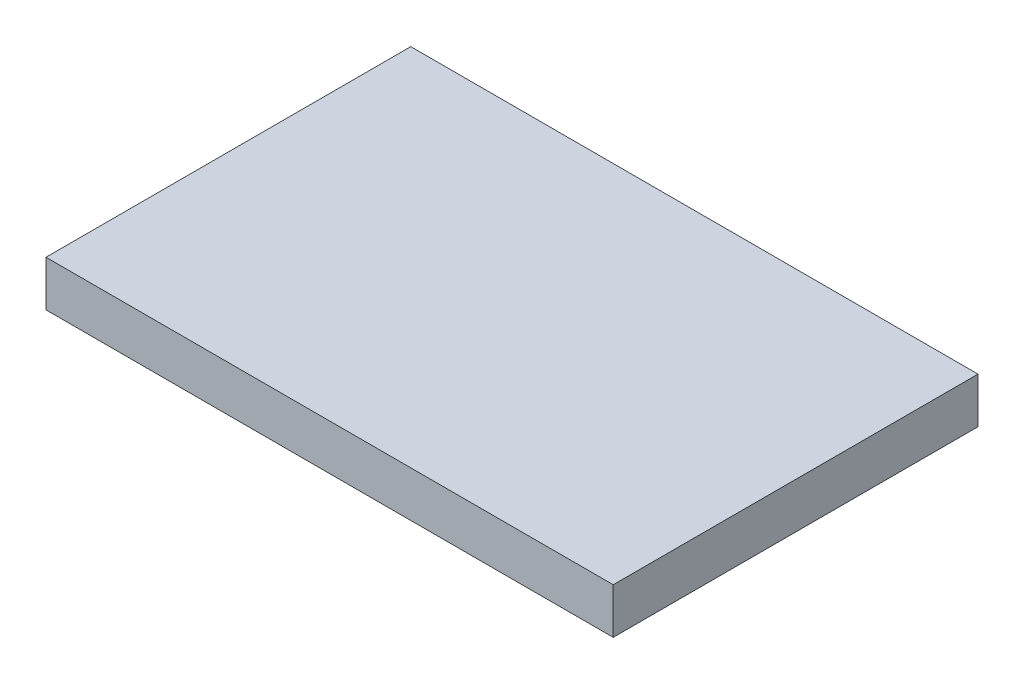
ISO-10303-21;
HEADER;
FILE_DESCRIPTION(('STEP AP214'),'2;1');
FILE_NAME('part.step','',(''),(''),'','','');
FILE_SCHEMA(('AUTOMOTIVE_DESIGN { 1 0 10303 214 1 1 1 1 }'));
ENDSEC;
DATA;
#1=APPLICATION_CONTEXT('core data for automotive mechanical design processes');
#2=APPLICATION_PROTOCOL_DEFINITION('international standard','automotive_design',2000,#1);
#3=PRODUCT_CONTEXT('',#1,'mechanical');
#4=PRODUCT('Part','Part','',(#3));
#5=PRODUCT_RELATED_PRODUCT_CATEGORY('part','',(#4));
#6=PRODUCT_DEFINITION_FORMATION('','',#4);
#7=PRODUCT_DEFINITION_CONTEXT('part definition',#1,'design');
#8=PRODUCT_DEFINITION('design','',#6,#7);
#9=PRODUCT_DEFINITION_SHAPE('','',#8);
#10=(LENGTH_UNIT() NAMED_UNIT(*) SI_UNIT(.MILLI.,.METRE.));
#11=(NAMED_UNIT(*) PLANE_ANGLE_UNIT() SI_UNIT($,.RADIAN.));
#12=(NAMED_UNIT(*) SI_UNIT($,.STERADIAN.) SOLID_ANGLE_UNIT());
#13=UNCERTAINTY_MEASURE_WITH_UNIT(LENGTH_MEASURE(1.E-05),#10,'distance_accuracy_value','');
#14=(GEOMETRIC_REPRESENTATION_CONTEXT(3) GLOBAL_UNCERTAINTY_ASSIGNED_CONTEXT((#13)) GLOBAL_UNIT_ASSIGNED_CONTEXT((#10,
#11,#12)) REPRESENTATION_CONTEXT('',''));
#15=CARTESIAN_POINT('',(0.,0.,0.));
#16=DIRECTION('',(0.,0.,1.));
#17=DIRECTION('',(1.,0.,0.));
#18=AXIS2_PLACEMENT_3D('',#15,#16,#17);
#19=CARTESIAN_POINT('',(62.1970259018667,39.8750870967758,39.9989784718606));
#20=DIRECTION('',(1.,0.,0.));
#21=DIRECTION('',(0.,0.,-1.));
#22=AXIS2_PLACEMENT_3D('',#19,#20,#21);
#23=PLANE('',#22);
#24=DIRECTION('',(0.,0.,1.));
#25=VECTOR('',#24,1.);
#26=CARTESIAN_POINT('',(62.1970259018667,29.8750870967758,39.9989784718606));
#27=LINE('',#26,#25);
#28=CARTESIAN_POINT('',(62.1970259018667,29.8750870967758,-39.9989784718606));
#29=VERTEX_POINT('',#28);
#30=CARTESIAN_POINT('',(62.1970259018667,29.8750870967758,39.9989784718606));
#31=VERTEX_POINT('',#30);
#32=EDGE_CURVE('E161',#29,#31,#27,.T.);
#33=ORIENTED_EDGE('',*,*,#32,.F.);
#34=DIRECTION('',(0.,-1.,0.));
#35=VECTOR('',#34,1.);
#36=CARTESIAN_POINT('',(62.1970259018667,39.8750870967758,-39.9989784718606));
#37=LINE('',#36,#35);
#38=CARTESIAN_POINT('',(62.1970259018667,39.8750870967758,-39.9989784718606));
#39=VERTEX_POINT('',#38);
#40=EDGE_CURVE('E159',#39,#29,#37,.T.);
#41=ORIENTED_EDGE('',*,*,#40,.F.);
#42=DIRECTION('',(0.,0.,1.));
#43=VECTOR('',#42,1.);
#44=CARTESIAN_POINT('',(62.1970259018667,39.8750870967758,39.9989784718606));
#45=LINE('',#44,#43);
#46=CARTESIAN_POINT('',(62.1970259018667,39.8750870967758,39.9989784718606));
#47=VERTEX_POINT('',#46);
#48=EDGE_CURVE('E164',#39,#47,#45,.T.);
#49=ORIENTED_EDGE('',*,*,#48,.T.);
#50=DIRECTION('',(0.,-1.,0.));
#51=VECTOR('',#50,1.);
#52=CARTESIAN_POINT('',(62.1970259018667,39.8750870967758,39.9989784718606));
#53=LINE('',#52,#51);
#54=EDGE_CURVE('E176',#47,#31,#53,.T.);
#55=ORIENTED_EDGE('',*,*,#54,.T.);
#56=EDGE_LOOP('',(#33,#41,#49,#55));
#57=FACE_BOUND('',#56,.T.);
#58=ADVANCED_FACE('F40',(#57),#23,.T.);
#59=CARTESIAN_POINT('',(-62.1970259018667,39.8750870967758,-39.9989784718606));
#60=DIRECTION('',(0.,0.,-1.));
#61=DIRECTION('',(-1.,0.,0.));
#62=AXIS2_PLACEMENT_3D('',#59,#60,#61);
#63=PLANE('',#62);
#64=DIRECTION('',(1.,0.,0.));
#65=VECTOR('',#64,1.);
#66=CARTESIAN_POINT('',(-62.1970259018667,29.8750870967758,-39.9989784718606));
#67=LINE('',#66,#65);
#68=CARTESIAN_POINT('',(-62.1970259018667,29.8750870967758,-39.9989784718606));
#69=VERTEX_POINT('',#68);
#70=EDGE_CURVE('E158',#69,#29,#67,.T.);
#71=ORIENTED_EDGE('',*,*,#70,.F.);
#72=DIRECTION('',(0.,-1.,0.));
#73=VECTOR('',#72,1.);
#74=CARTESIAN_POINT('',(-62.1970259018667,39.8750870967758,-39.9989784718606));
#75=LINE('',#74,#73);
#76=CARTESIAN_POINT('',(-62.1970259018667,39.8750870967758,-39.9989784718606));
#77=VERTEX_POINT('',#76);
#78=EDGE_CURVE('E179',#77,#69,#75,.T.);
#79=ORIENTED_EDGE('',*,*,#78,.F.);
#80=DIRECTION('',(1.,0.,0.));
#81=VECTOR('',#80,1.);
#82=CARTESIAN_POINT('',(-62.1970259018667,39.8750870967758,-39.9989784718606));
#83=LINE('',#82,#81);
#84=EDGE_CURVE('E173',#77,#39,#83,.T.);
#85=ORIENTED_EDGE('',*,*,#84,.T.);
#86=ORIENTED_EDGE('',*,*,#40,.T.);
#87=EDGE_LOOP('',(#71,#79,#85,#86));
#88=FACE_BOUND('',#87,.T.);
#89=ADVANCED_FACE('F259',(#88),#63,.T.);
#90=CARTESIAN_POINT('',(-62.1970259018667,39.8750870967758,39.9989784718606));
#91=DIRECTION('',(-1.,0.,0.));
#92=DIRECTION('',(0.,0.,1.));
#93=AXIS2_PLACEMENT_3D('',#90,#91,#92);
#94=PLANE('',#93);
#95=DIRECTION('',(0.,0.,-1.));
#96=VECTOR('',#95,1.);
#97=CARTESIAN_POINT('',(-62.1970259018667,29.8750870967758,39.9989784718606));
#98=LINE('',#97,#96);
#99=CARTESIAN_POINT('',(-62.1970259018667,29.8750870967758,39.9989784718606));
#100=VERTEX_POINT('',#99);
#101=EDGE_CURVE('E155',#100,#69,#98,.T.);
#102=ORIENTED_EDGE('',*,*,#101,.F.);
#103=DIRECTION('',(0.,-1.,0.));
#104=VECTOR('',#103,1.);
#105=CARTESIAN_POINT('',(-62.1970259018667,39.8750870967758,39.9989784718606));
#106=LINE('',#105,#104);
#107=CARTESIAN_POINT('',(-62.1970259018667,39.8750870967758,39.9989784718606));
#108=VERTEX_POINT('',#107);
#109=EDGE_CURVE('E182',#108,#100,#106,.T.);
#110=ORIENTED_EDGE('',*,*,#109,.F.);
#111=DIRECTION('',(0.,0.,-1.));
#112=VECTOR('',#111,1.);
#113=CARTESIAN_POINT('',(-62.1970259018667,39.8750870967758,39.9989784718606));
#114=LINE('',#113,#112);
#115=EDGE_CURVE('E170',#108,#77,#114,.T.);
#116=ORIENTED_EDGE('',*,*,#115,.T.);
#117=ORIENTED_EDGE('',*,*,#78,.T.);
#118=EDGE_LOOP('',(#102,#110,#116,#117));
#119=FACE_BOUND('',#118,.T.);
#120=ADVANCED_FACE('F263',(#119),#94,.T.);
#121=CARTESIAN_POINT('',(-62.1970259018667,39.8750870967758,39.9989784718606));
#122=DIRECTION('',(0.,0.,1.));
#123=DIRECTION('',(1.,0.,0.));
#124=AXIS2_PLACEMENT_3D('',#121,#122,#123);
#125=PLANE('',#124);
#126=DIRECTION('',(-1.,0.,0.));
#127=VECTOR('',#126,1.);
#128=CARTESIAN_POINT('',(-62.1970259018667,29.8750870967758,39.9989784718606));
#129=LINE('',#128,#127);
#130=EDGE_CURVE('E43',#31,#100,#129,.T.);
#131=ORIENTED_EDGE('',*,*,#130,.F.);
#132=ORIENTED_EDGE('',*,*,#54,.F.);
#133=DIRECTION('',(-1.,0.,0.));
#134=VECTOR('',#133,1.);
#135=CARTESIAN_POINT('',(-62.1970259018667,39.8750870967758,39.9989784718606));
#136=LINE('',#135,#134);
#137=EDGE_CURVE('E167',#47,#108,#136,.T.);
#138=ORIENTED_EDGE('',*,*,#137,.T.);
#139=ORIENTED_EDGE('',*,*,#109,.T.);
#140=EDGE_LOOP('',(#131,#132,#138,#139));
#141=FACE_BOUND('',#140,.T.);
#142=ADVANCED_FACE('F197',(#141),#125,.T.);
#143=CARTESIAN_POINT('',(0.,39.8750870967758,0.));
#144=DIRECTION('',(0.,-1.,0.));
#145=DIRECTION('',(0.,0.,-1.));
#146=AXIS2_PLACEMENT_3D('',#143,#144,#145);
#147=PLANE('',#146);
#148=ORIENTED_EDGE('',*,*,#48,.F.);
#149=ORIENTED_EDGE('',*,*,#84,.F.);
#150=ORIENTED_EDGE('',*,*,#115,.F.);
#151=ORIENTED_EDGE('',*,*,#137,.F.);
#152=EDGE_LOOP('',(#148,#149,#150,#151));
#153=FACE_BOUND('',#152,.T.);
#154=ADVANCED_FACE('F273',(#153),#147,.F.);
#155=CARTESIAN_POINT('',(0.,35.1250870967758,0.));
#156=DIRECTION('',(0.,1.,0.));
#157=DIRECTION('',(0.,0.,1.));
#158=AXIS2_PLACEMENT_3D('',#155,#156,#157);
#159=PLANE('',#158);
#160=DIRECTION('',(-1.,0.,0.));
#161=VECTOR('',#160,1.);
#162=CARTESIAN_POINT('',(-52.5,35.1250870967758,31.4083609091269));
#163=LINE('',#162,#161);
#164=CARTESIAN_POINT('',(-41.9099601099847,35.1250870967758,31.4083609091269));
#165=VERTEX_POINT('',#164);
#166=CARTESIAN_POINT('',(41.9099601099848,35.1250870967758,31.4083609091269));
#167=VERTEX_POINT('',#166);
#168=EDGE_CURVE('E201',#165,#167,#163,.F.);
#169=ORIENTED_EDGE('',*,*,#168,.F.);
#170=CARTESIAN_POINT('',(-41.9067614646658,35.1250870967758,20.9067614646658));
#171=DIRECTION('',(0.,1.,0.));
#172=DIRECTION('',(-0.707106781186547,0.,0.707106781186548));
#173=AXIS2_PLACEMENT_3D('',#170,#171,#172);
#174=ELLIPSE('',#173,10.503198645356,10.5);
#175=CARTESIAN_POINT('',(-52.4083609091268,35.1250870967758,20.9099601099847));
#176=VERTEX_POINT('',#175);
#177=EDGE_CURVE('E132',#176,#165,#174,.T.);
#178=ORIENTED_EDGE('',*,*,#177,.F.);
#179=DIRECTION('',(0.,0.,-1.));
#180=VECTOR('',#179,1.);
#181=CARTESIAN_POINT('',(-52.4083609091269,35.1250870967758,-31.5));
#182=LINE('',#181,#180);
#183=CARTESIAN_POINT('',(-52.4083609091269,35.1250870967758,-20.9099601099847));
#184=VERTEX_POINT('',#183);
#185=EDGE_CURVE('E135',#184,#176,#182,.F.);
#186=ORIENTED_EDGE('',*,*,#185,.F.);
#187=CARTESIAN_POINT('',(-41.9067614646658,35.1250870967758,-20.9067614646658));
#188=DIRECTION('',(0.,1.,0.));
#189=DIRECTION('',(-0.707106781186548,0.,-0.707106781186547));
#190=AXIS2_PLACEMENT_3D('',#187,#188,#189);
#191=ELLIPSE('',#190,10.503198645356,10.5);
#192=CARTESIAN_POINT('',(-41.9099601099847,35.1250870967758,-31.4083609091269));
#193=VERTEX_POINT('',#192);
#194=EDGE_CURVE('E211',#193,#184,#191,.T.);
#195=ORIENTED_EDGE('',*,*,#194,.F.);
#196=DIRECTION('',(1.,0.,0.));
#197=VECTOR('',#196,1.);
#198=CARTESIAN_POINT('',(-52.5,35.1250870967758,-31.4083609091269));
#199=LINE('',#198,#197);
#200=CARTESIAN_POINT('',(41.9099601099847,35.1250870967758,-31.4083609091269));
#201=VERTEX_POINT('',#200);
#202=EDGE_CURVE('E98',#201,#193,#199,.F.);
#203=ORIENTED_EDGE('',*,*,#202,.F.);
#204=CARTESIAN_POINT('',(41.9067614646658,35.1250870967758,-20.9067614646658));
#205=DIRECTION('',(0.,1.,0.));
#206=DIRECTION('',(0.707106781186547,0.,-0.707106781186548));
#207=AXIS2_PLACEMENT_3D('',#204,#205,#206);
#208=ELLIPSE('',#207,10.503198645356,10.5);
#209=CARTESIAN_POINT('',(52.4083609091269,35.1250870967758,-20.9099601099847));
#210=VERTEX_POINT('',#209);
#211=EDGE_CURVE('E90',#210,#201,#208,.T.);
#212=ORIENTED_EDGE('',*,*,#211,.F.);
#213=DIRECTION('',(0.,0.,1.));
#214=VECTOR('',#213,1.);
#215=CARTESIAN_POINT('',(52.4083609091269,35.1250870967758,-31.5));
#216=LINE('',#215,#214);
#217=CARTESIAN_POINT('',(52.4083609091269,35.1250870967758,20.9099601099847));
#218=VERTEX_POINT('',#217);
#219=EDGE_CURVE('E83',#218,#210,#216,.F.);
#220=ORIENTED_EDGE('',*,*,#219,.F.);
#221=CARTESIAN_POINT('',(41.9067614646658,35.1250870967758,20.9067614646658));
#222=DIRECTION('',(0.,1.,0.));
#223=DIRECTION('',(0.707106781186548,0.,0.707106781186547));
#224=AXIS2_PLACEMENT_3D('',#221,#222,#223);
#225=ELLIPSE('',#224,10.503198645356,10.5);
#226=EDGE_CURVE('E131',#167,#218,#225,.T.);
#227=ORIENTED_EDGE('',*,*,#226,.F.);
#228=EDGE_LOOP('',(#169,#178,#186,#195,#203,#212,#220,#227));
#229=FACE_BOUND('',#228,.T.);
#230=ADVANCED_FACE('F248',(#229),#159,.F.);
#231=CARTESIAN_POINT('',(52.5,29.8750870967758,-31.5));
#232=DIRECTION('',(0.999847695156391,0.0174524064372835,0.));
#233=DIRECTION('',(-0.0174524064372835,0.999847695156391,0.));
#234=AXIS2_PLACEMENT_3D('',#231,#232,#233);
#235=PLANE('',#234);
#236=ORIENTED_EDGE('',*,*,#219,.T.);
#237=DIRECTION('',(-0.0174497491606827,0.999695459881888,0.0174497491606827));
#238=VECTOR('',#237,1.);
#239=CARTESIAN_POINT('',(52.5031966973839,29.6919484263051,-21.0047958982418));
#240=LINE('',#239,#238);
#241=CARTESIAN_POINT('',(52.5,29.8750870967758,-21.0015992008579));
#242=VERTEX_POINT('',#241);
#243=EDGE_CURVE('E121',#242,#210,#240,.T.);
#244=ORIENTED_EDGE('',*,*,#243,.F.);
#245=DIRECTION('',(0.,0.,-1.));
#246=VECTOR('',#245,1.);
#247=CARTESIAN_POINT('',(52.5,29.8750870967758,-31.5));
#248=LINE('',#247,#246);
#249=CARTESIAN_POINT('',(52.5,29.8750870967758,21.0015992008579));
#250=VERTEX_POINT('',#249);
#251=EDGE_CURVE('E118',#250,#242,#248,.T.);
#252=ORIENTED_EDGE('',*,*,#251,.F.);
#253=DIRECTION('',(-0.0174497491606827,0.999695459881888,-0.0174497491606827));
#254=VECTOR('',#253,1.);
#255=CARTESIAN_POINT('',(52.4840135914004,30.7909478320619,20.9856127922583));
#256=LINE('',#255,#254);
#257=EDGE_CURVE('E120',#218,#250,#256,.F.);
#258=ORIENTED_EDGE('',*,*,#257,.F.);
#259=EDGE_LOOP('',(#236,#244,#252,#258));
#260=FACE_BOUND('',#259,.T.);
#261=ADVANCED_FACE('F119',(#260),#235,.F.);
#262=CARTESIAN_POINT('',(41.9728240549359,31.3403638349749,-20.9728240549359));
#263=DIRECTION('',(0.0174497491606827,-0.999695459881887,-0.0174497491606827));
#264=DIRECTION('',(0.,0.0174524064372835,-0.999847695156391));
#265=AXIS2_PLACEMENT_3D('',#262,#263,#264);
#266=CYLINDRICAL_SURFACE('',#265,10.5);
#267=ORIENTED_EDGE('',*,*,#211,.T.);
#268=DIRECTION('',(-0.0174497491606827,0.999695459881888,0.0174497491606827));
#269=VECTOR('',#268,1.);
#270=CARTESIAN_POINT('',(41.9728240549359,31.5236141025664,-31.471224854078));
#271=LINE('',#270,#269);
#272=CARTESIAN_POINT('',(42.0015992008579,29.8750870967758,-31.5));
#273=VERTEX_POINT('',#272);
#274=EDGE_CURVE('E142',#201,#273,#271,.F.);
#275=ORIENTED_EDGE('',*,*,#274,.T.);
#276=CARTESIAN_POINT('',(41.998400555539,29.8750870967758,-20.998400555539));
#277=DIRECTION('',(0.,1.,0.));
#278=DIRECTION('',(0.707106781186547,0.,-0.707106781186548));
#279=AXIS2_PLACEMENT_3D('',#276,#277,#278);
#280=ELLIPSE('',#279,10.503198645356,10.5);
#281=EDGE_CURVE('E115',#273,#242,#280,.F.);
#282=ORIENTED_EDGE('',*,*,#281,.T.);
#283=ORIENTED_EDGE('',*,*,#243,.T.);
#284=EDGE_LOOP('',(#267,#275,#282,#283));
#285=FACE_BOUND('',#284,.T.);
#286=ADVANCED_FACE('F301',(#285),#266,.F.);
#287=CARTESIAN_POINT('',(-52.5,29.8750870967758,-31.5));
#288=DIRECTION('',(0.,0.0174524064372835,-0.999847695156391));
#289=DIRECTION('',(0.,0.999847695156391,0.0174524064372835));
#290=AXIS2_PLACEMENT_3D('',#287,#288,#289);
#291=PLANE('',#290);
#292=ORIENTED_EDGE('',*,*,#202,.T.);
#293=DIRECTION('',(0.0174497491606827,0.999695459881888,0.0174497491606827));
#294=VECTOR('',#293,1.);
#295=CARTESIAN_POINT('',(-42.0047958982418,29.6919484263051,-31.5031966973839));
#296=LINE('',#295,#294);
#297=CARTESIAN_POINT('',(-42.0015992008579,29.8750870967758,-31.5));
#298=VERTEX_POINT('',#297);
#299=EDGE_CURVE('E148',#298,#193,#296,.T.);
#300=ORIENTED_EDGE('',*,*,#299,.F.);
#301=DIRECTION('',(-1.,0.,0.));
#302=VECTOR('',#301,1.);
#303=CARTESIAN_POINT('',(-52.5,29.8750870967758,-31.5));
#304=LINE('',#303,#302);
#305=EDGE_CURVE('E216',#273,#298,#304,.T.);
#306=ORIENTED_EDGE('',*,*,#305,.F.);
#307=ORIENTED_EDGE('',*,*,#274,.F.);
#308=EDGE_LOOP('',(#292,#300,#306,#307));
#309=FACE_BOUND('',#308,.T.);
#310=ADVANCED_FACE('F304',(#309),#291,.F.);
#311=CARTESIAN_POINT('',(-42.0047958982418,29.5086981587136,-21.0047958982418));
#312=DIRECTION('',(-0.0174497491606827,-0.999695459881887,-0.0174497491606827));
#313=DIRECTION('',(0.999847695156391,-0.0174524064372836,0.));
#314=AXIS2_PLACEMENT_3D('',#311,#312,#313);
#315=CYLINDRICAL_SURFACE('',#314,10.5);
#316=ORIENTED_EDGE('',*,*,#194,.T.);
#317=DIRECTION('',(0.0174497491606827,0.999695459881888,0.0174497491606827));
#318=VECTOR('',#317,1.);
#319=CARTESIAN_POINT('',(-52.5031966973839,29.6919484263051,-21.0047958982418));
#320=LINE('',#319,#318);
#321=CARTESIAN_POINT('',(-52.5,29.8750870967758,-21.0015992008579));
#322=VERTEX_POINT('',#321);
#323=EDGE_CURVE('E147',#184,#322,#320,.F.);
#324=ORIENTED_EDGE('',*,*,#323,.T.);
#325=CARTESIAN_POINT('',(-41.998400555539,29.8750870967758,-20.998400555539));
#326=DIRECTION('',(0.,1.,0.));
#327=DIRECTION('',(-0.707106781186548,0.,-0.707106781186547));
#328=AXIS2_PLACEMENT_3D('',#325,#326,#327);
#329=ELLIPSE('',#328,10.503198645356,10.5);
#330=EDGE_CURVE('E143',#322,#298,#329,.F.);
#331=ORIENTED_EDGE('',*,*,#330,.T.);
#332=ORIENTED_EDGE('',*,*,#299,.T.);
#333=EDGE_LOOP('',(#316,#324,#331,#332));
#334=FACE_BOUND('',#333,.T.);
#335=ADVANCED_FACE('F245',(#334),#315,.F.);
#336=CARTESIAN_POINT('',(-52.5,29.8750870967758,-31.5));
#337=DIRECTION('',(-0.999847695156391,0.0174524064372835,0.));
#338=DIRECTION('',(-0.0174524064372835,-0.999847695156391,0.));
#339=AXIS2_PLACEMENT_3D('',#336,#337,#338);
#340=PLANE('',#339);
#341=ORIENTED_EDGE('',*,*,#185,.T.);
#342=DIRECTION('',(0.0174497491606827,0.999695459881888,-0.0174497491606827));
#343=VECTOR('',#342,1.);
#344=CARTESIAN_POINT('',(-52.4840135914004,30.7909478320619,20.9856127922583));
#345=LINE('',#344,#343);
#346=CARTESIAN_POINT('',(-52.5,29.8750870967758,21.0015992008579));
#347=VERTEX_POINT('',#346);
#348=EDGE_CURVE('E153',#347,#176,#345,.T.);
#349=ORIENTED_EDGE('',*,*,#348,.F.);
#350=DIRECTION('',(0.,0.,1.));
#351=VECTOR('',#350,1.);
#352=CARTESIAN_POINT('',(-52.5,29.8750870967758,-31.5));
#353=LINE('',#352,#351);
#354=EDGE_CURVE('E225',#322,#347,#353,.T.);
#355=ORIENTED_EDGE('',*,*,#354,.F.);
#356=ORIENTED_EDGE('',*,*,#323,.F.);
#357=EDGE_LOOP('',(#341,#349,#355,#356));
#358=FACE_BOUND('',#357,.T.);
#359=ADVANCED_FACE('F242',(#358),#340,.F.);
#360=CARTESIAN_POINT('',(-42.0047958982418,29.5086981587136,21.0047958982418));
#361=DIRECTION('',(-0.0174497491606827,-0.999695459881887,0.0174497491606827));
#362=DIRECTION('',(0.,-0.0174524064372835,-0.999847695156391));
#363=AXIS2_PLACEMENT_3D('',#360,#361,#362);
#364=CYLINDRICAL_SURFACE('',#363,10.5);
#365=ORIENTED_EDGE('',*,*,#177,.T.);
#366=DIRECTION('',(0.0174497491606827,0.999695459881888,-0.0174497491606827));
#367=VECTOR('',#366,1.);
#368=CARTESIAN_POINT('',(-42.0047958982418,29.6919484263051,31.5031966973839));
#369=LINE('',#368,#367);
#370=CARTESIAN_POINT('',(-42.0015992008579,29.8750870967758,31.5));
#371=VERTEX_POINT('',#370);
#372=EDGE_CURVE('E152',#165,#371,#369,.F.);
#373=ORIENTED_EDGE('',*,*,#372,.T.);
#374=CARTESIAN_POINT('',(-41.998400555539,29.8750870967758,20.998400555539));
#375=DIRECTION('',(0.,1.,0.));
#376=DIRECTION('',(-0.707106781186547,0.,0.707106781186548));
#377=AXIS2_PLACEMENT_3D('',#374,#375,#376);
#378=ELLIPSE('',#377,10.503198645356,10.5);
#379=EDGE_CURVE('E149',#371,#347,#378,.F.);
#380=ORIENTED_EDGE('',*,*,#379,.T.);
#381=ORIENTED_EDGE('',*,*,#348,.T.);
#382=EDGE_LOOP('',(#365,#373,#380,#381));
#383=FACE_BOUND('',#382,.T.);
#384=ADVANCED_FACE('F234',(#383),#364,.F.);
#385=CARTESIAN_POINT('',(-52.5,29.8750870967758,31.5));
#386=DIRECTION('',(0.,0.0174524064372835,0.999847695156391));
#387=DIRECTION('',(0.,-0.999847695156391,0.0174524064372835));
#388=AXIS2_PLACEMENT_3D('',#385,#386,#387);
#389=PLANE('',#388);
#390=DIRECTION('',(1.,0.,0.));
#391=VECTOR('',#390,1.);
#392=CARTESIAN_POINT('',(-52.5,29.8750870967758,31.5));
#393=LINE('',#392,#391);
#394=CARTESIAN_POINT('',(42.0015992008579,29.8750870967758,31.5));
#395=VERTEX_POINT('',#394);
#396=EDGE_CURVE('E129',#371,#395,#393,.T.);
#397=ORIENTED_EDGE('',*,*,#396,.F.);
#398=ORIENTED_EDGE('',*,*,#372,.F.);
#399=ORIENTED_EDGE('',*,*,#168,.T.);
#400=DIRECTION('',(-0.0174497491606827,0.999695459881888,-0.0174497491606827));
#401=VECTOR('',#400,1.);
#402=CARTESIAN_POINT('',(41.9728240549359,31.5236141025664,31.471224854078));
#403=LINE('',#402,#401);
#404=EDGE_CURVE('E50',#395,#167,#403,.T.);
#405=ORIENTED_EDGE('',*,*,#404,.F.);
#406=EDGE_LOOP('',(#397,#398,#399,#405));
#407=FACE_BOUND('',#406,.T.);
#408=ADVANCED_FACE('F249',(#407),#389,.F.);
#409=CARTESIAN_POINT('',(41.9856127922583,30.6076975644704,20.9856127922583));
#410=DIRECTION('',(0.0174497491606827,-0.999695459881887,0.0174497491606827));
#411=DIRECTION('',(0.999847695156391,0.0174524064372836,0.));
#412=AXIS2_PLACEMENT_3D('',#409,#410,#411);
#413=CYLINDRICAL_SURFACE('',#412,10.5);
#414=ORIENTED_EDGE('',*,*,#226,.T.);
#415=ORIENTED_EDGE('',*,*,#257,.T.);
#416=CARTESIAN_POINT('',(41.998400555539,29.8750870967758,20.998400555539));
#417=DIRECTION('',(0.,1.,0.));
#418=DIRECTION('',(0.707106781186548,0.,0.707106781186547));
#419=AXIS2_PLACEMENT_3D('',#416,#417,#418);
#420=ELLIPSE('',#419,10.503198645356,10.5);
#421=EDGE_CURVE('E11',#250,#395,#420,.F.);
#422=ORIENTED_EDGE('',*,*,#421,.T.);
#423=ORIENTED_EDGE('',*,*,#404,.T.);
#424=EDGE_LOOP('',(#414,#415,#422,#423));
#425=FACE_BOUND('',#424,.T.);
#426=ADVANCED_FACE('F130',(#425),#413,.F.);
#427=CARTESIAN_POINT('',(-52.5,29.8750870967758,-21.0015992008579));
#428=DIRECTION('',(0.,1.,0.));
#429=DIRECTION('',(0.707106781186547,0.,-0.707106781186547));
#430=AXIS2_PLACEMENT_3D('',#427,#428,#429);
#431=PLANE('',#430);
#432=ORIENTED_EDGE('',*,*,#32,.T.);
#433=ORIENTED_EDGE('',*,*,#130,.T.);
#434=ORIENTED_EDGE('',*,*,#101,.T.);
#435=ORIENTED_EDGE('',*,*,#70,.T.);
#436=EDGE_LOOP('',(#432,#433,#434,#435));
#437=FACE_BOUND('',#436,.T.);
#438=ORIENTED_EDGE('',*,*,#330,.F.);
#439=ORIENTED_EDGE('',*,*,#354,.T.);
#440=ORIENTED_EDGE('',*,*,#379,.F.);
#441=ORIENTED_EDGE('',*,*,#396,.T.);
#442=ORIENTED_EDGE('',*,*,#421,.F.);
#443=ORIENTED_EDGE('',*,*,#251,.T.);
#444=ORIENTED_EDGE('',*,*,#281,.F.);
#445=ORIENTED_EDGE('',*,*,#305,.T.);
#446=EDGE_LOOP('',(#438,#439,#440,#441,#442,#443,#444,#445));
#447=FACE_BOUND('',#446,.T.);
#448=ADVANCED_FACE('F127',(#437,#447),#431,.F.);
#449=CLOSED_SHELL('',(#58,#89,#120,#142,#154,#230,#261,#286,#310,#335,#359,#384,#408,#426,#448));
#450=MANIFOLD_SOLID_BREP('B2',#449);
#451=ADVANCED_BREP_SHAPE_REPRESENTATION('',(#18,#450),#14);
#452=SHAPE_DEFINITION_REPRESENTATION(#9,#451);
ENDSEC;
END-ISO-10303-21;
